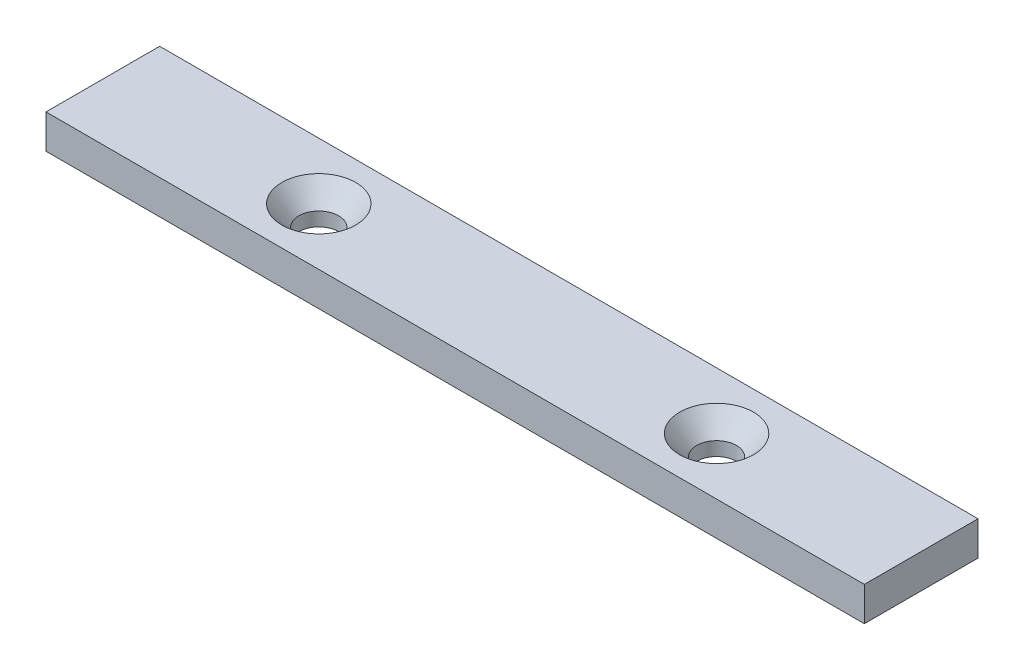
ISO-10303-21;
HEADER;
FILE_DESCRIPTION(('STEP AP214'),'2;1');
FILE_NAME('part.step','',(''),(''),'','','');
FILE_SCHEMA(('AUTOMOTIVE_DESIGN { 1 0 10303 214 1 1 1 1 }'));
ENDSEC;
DATA;
#1=APPLICATION_CONTEXT('core data for automotive mechanical design processes');
#2=APPLICATION_PROTOCOL_DEFINITION('international standard','automotive_design',2000,#1);
#3=PRODUCT_CONTEXT('',#1,'mechanical');
#4=PRODUCT('Part','Part','',(#3));
#5=PRODUCT_RELATED_PRODUCT_CATEGORY('part','',(#4));
#6=PRODUCT_DEFINITION_FORMATION('','',#4);
#7=PRODUCT_DEFINITION_CONTEXT('part definition',#1,'design');
#8=PRODUCT_DEFINITION('design','',#6,#7);
#9=PRODUCT_DEFINITION_SHAPE('','',#8);
#10=(LENGTH_UNIT() NAMED_UNIT(*) SI_UNIT(.MILLI.,.METRE.));
#11=(NAMED_UNIT(*) PLANE_ANGLE_UNIT() SI_UNIT($,.RADIAN.));
#12=(NAMED_UNIT(*) SI_UNIT($,.STERADIAN.) SOLID_ANGLE_UNIT());
#13=UNCERTAINTY_MEASURE_WITH_UNIT(LENGTH_MEASURE(1.E-05),#10,'distance_accuracy_value','');
#14=(GEOMETRIC_REPRESENTATION_CONTEXT(3) GLOBAL_UNCERTAINTY_ASSIGNED_CONTEXT((#13)) GLOBAL_UNIT_ASSIGNED_CONTEXT((#10,
#11,#12)) REPRESENTATION_CONTEXT('',''));
#15=CARTESIAN_POINT('',(0.,0.,0.));
#16=DIRECTION('',(0.,0.,1.));
#17=DIRECTION('',(1.,0.,0.));
#18=AXIS2_PLACEMENT_3D('',#15,#16,#17);
#19=CARTESIAN_POINT('',(0.,6.,0.));
#20=DIRECTION('',(1.,0.,0.));
#21=DIRECTION('',(0.,0.,-1.));
#22=AXIS2_PLACEMENT_3D('',#19,#20,#21);
#23=PLANE('',#22);
#24=DIRECTION('',(0.,0.,1.));
#25=VECTOR('',#24,1.);
#26=CARTESIAN_POINT('',(0.,0.,0.));
#27=LINE('',#26,#25);
#28=CARTESIAN_POINT('',(0.,0.,-20.));
#29=VERTEX_POINT('',#28);
#30=CARTESIAN_POINT('',(0.,0.,0.));
#31=VERTEX_POINT('',#30);
#32=EDGE_CURVE('E99',#29,#31,#27,.T.);
#33=ORIENTED_EDGE('',*,*,#32,.T.);
#34=DIRECTION('',(0.,-1.,0.));
#35=VECTOR('',#34,1.);
#36=CARTESIAN_POINT('',(0.,6.,0.));
#37=LINE('',#36,#35);
#38=CARTESIAN_POINT('',(0.,6.,0.));
#39=VERTEX_POINT('',#38);
#40=EDGE_CURVE('E11',#39,#31,#37,.T.);
#41=ORIENTED_EDGE('',*,*,#40,.F.);
#42=DIRECTION('',(0.,0.,1.));
#43=VECTOR('',#42,1.);
#44=CARTESIAN_POINT('',(0.,6.,0.));
#45=LINE('',#44,#43);
#46=CARTESIAN_POINT('',(0.,6.,-20.));
#47=VERTEX_POINT('',#46);
#48=EDGE_CURVE('E87',#47,#39,#45,.T.);
#49=ORIENTED_EDGE('',*,*,#48,.F.);
#50=DIRECTION('',(0.,-1.,0.));
#51=VECTOR('',#50,1.);
#52=CARTESIAN_POINT('',(0.,6.,-20.));
#53=LINE('',#52,#51);
#54=EDGE_CURVE('E95',#47,#29,#53,.T.);
#55=ORIENTED_EDGE('',*,*,#54,.T.);
#56=EDGE_LOOP('',(#33,#41,#49,#55));
#57=FACE_BOUND('',#56,.T.);
#58=ADVANCED_FACE('F36',(#57),#23,.F.);
#59=CARTESIAN_POINT('',(0.,6.,0.));
#60=DIRECTION('',(0.,0.,-1.));
#61=DIRECTION('',(-1.,0.,0.));
#62=AXIS2_PLACEMENT_3D('',#59,#60,#61);
#63=PLANE('',#62);
#64=DIRECTION('',(1.,0.,0.));
#65=VECTOR('',#64,1.);
#66=CARTESIAN_POINT('',(0.,0.,0.));
#67=LINE('',#66,#65);
#68=CARTESIAN_POINT('',(144.,0.,0.));
#69=VERTEX_POINT('',#68);
#70=EDGE_CURVE('E91',#31,#69,#67,.T.);
#71=ORIENTED_EDGE('',*,*,#70,.T.);
#72=DIRECTION('',(0.,-1.,0.));
#73=VECTOR('',#72,1.);
#74=CARTESIAN_POINT('',(144.,6.,0.));
#75=LINE('',#74,#73);
#76=CARTESIAN_POINT('',(144.,6.,0.));
#77=VERTEX_POINT('',#76);
#78=EDGE_CURVE('E44',#77,#69,#75,.T.);
#79=ORIENTED_EDGE('',*,*,#78,.F.);
#80=DIRECTION('',(1.,0.,0.));
#81=VECTOR('',#80,1.);
#82=CARTESIAN_POINT('',(0.,6.,0.));
#83=LINE('',#82,#81);
#84=EDGE_CURVE('E82',#39,#77,#83,.T.);
#85=ORIENTED_EDGE('',*,*,#84,.F.);
#86=ORIENTED_EDGE('',*,*,#40,.T.);
#87=EDGE_LOOP('',(#71,#79,#85,#86));
#88=FACE_BOUND('',#87,.T.);
#89=ADVANCED_FACE('F90',(#88),#63,.F.);
#90=CARTESIAN_POINT('',(144.,6.,0.));
#91=DIRECTION('',(-1.,0.,0.));
#92=DIRECTION('',(0.,0.,1.));
#93=AXIS2_PLACEMENT_3D('',#90,#91,#92);
#94=PLANE('',#93);
#95=DIRECTION('',(0.,0.,-1.));
#96=VECTOR('',#95,1.);
#97=CARTESIAN_POINT('',(144.,0.,0.));
#98=LINE('',#97,#96);
#99=CARTESIAN_POINT('',(144.,0.,-20.));
#100=VERTEX_POINT('',#99);
#101=EDGE_CURVE('E69',#69,#100,#98,.T.);
#102=ORIENTED_EDGE('',*,*,#101,.T.);
#103=DIRECTION('',(0.,-1.,0.));
#104=VECTOR('',#103,1.);
#105=CARTESIAN_POINT('',(144.,6.,-20.));
#106=LINE('',#105,#104);
#107=CARTESIAN_POINT('',(144.,6.,-20.));
#108=VERTEX_POINT('',#107);
#109=EDGE_CURVE('E92',#108,#100,#106,.T.);
#110=ORIENTED_EDGE('',*,*,#109,.F.);
#111=DIRECTION('',(0.,0.,-1.));
#112=VECTOR('',#111,1.);
#113=CARTESIAN_POINT('',(144.,6.,0.));
#114=LINE('',#113,#112);
#115=EDGE_CURVE('E85',#77,#108,#114,.T.);
#116=ORIENTED_EDGE('',*,*,#115,.F.);
#117=ORIENTED_EDGE('',*,*,#78,.T.);
#118=EDGE_LOOP('',(#102,#110,#116,#117));
#119=FACE_BOUND('',#118,.T.);
#120=ADVANCED_FACE('F93',(#119),#94,.F.);
#121=CARTESIAN_POINT('',(0.,6.,-20.));
#122=DIRECTION('',(0.,0.,1.));
#123=DIRECTION('',(1.,0.,0.));
#124=AXIS2_PLACEMENT_3D('',#121,#122,#123);
#125=PLANE('',#124);
#126=DIRECTION('',(-1.,0.,0.));
#127=VECTOR('',#126,1.);
#128=CARTESIAN_POINT('',(0.,0.,-20.));
#129=LINE('',#128,#127);
#130=EDGE_CURVE('E75',#100,#29,#129,.T.);
#131=ORIENTED_EDGE('',*,*,#130,.T.);
#132=ORIENTED_EDGE('',*,*,#54,.F.);
#133=DIRECTION('',(-1.,0.,0.));
#134=VECTOR('',#133,1.);
#135=CARTESIAN_POINT('',(0.,6.,-20.));
#136=LINE('',#135,#134);
#137=EDGE_CURVE('E52',#108,#47,#136,.T.);
#138=ORIENTED_EDGE('',*,*,#137,.F.);
#139=ORIENTED_EDGE('',*,*,#109,.T.);
#140=EDGE_LOOP('',(#131,#132,#138,#139));
#141=FACE_BOUND('',#140,.T.);
#142=ADVANCED_FACE('F107',(#141),#125,.F.);
#143=CARTESIAN_POINT('',(0.,6.,0.));
#144=DIRECTION('',(0.,-1.,0.));
#145=DIRECTION('',(0.,0.,-1.));
#146=AXIS2_PLACEMENT_3D('',#143,#144,#145);
#147=PLANE('',#146);
#148=CARTESIAN_POINT('',(38.,6.,-10.));
#149=DIRECTION('',(0.,1.,0.));
#150=DIRECTION('',(0.,0.,1.));
#151=AXIS2_PLACEMENT_3D('',#148,#149,#150);
#152=CIRCLE('',#151,6.5);
#153=CARTESIAN_POINT('',(38.,6.,-3.5));
#154=VERTEX_POINT('',#153);
#155=EDGE_CURVE('E127',#154,#154,#152,.T.);
#156=ORIENTED_EDGE('',*,*,#155,.F.);
#157=EDGE_LOOP('',(#156));
#158=FACE_BOUND('',#157,.T.);
#159=CARTESIAN_POINT('',(108.,6.,-10.));
#160=DIRECTION('',(0.,1.,0.));
#161=DIRECTION('',(0.,0.,1.));
#162=AXIS2_PLACEMENT_3D('',#159,#160,#161);
#163=CIRCLE('',#162,6.50000000000001);
#164=CARTESIAN_POINT('',(108.,6.,-3.49999999999999));
#165=VERTEX_POINT('',#164);
#166=EDGE_CURVE('E118',#165,#165,#163,.T.);
#167=ORIENTED_EDGE('',*,*,#166,.F.);
#168=EDGE_LOOP('',(#167));
#169=FACE_BOUND('',#168,.T.);
#170=ORIENTED_EDGE('',*,*,#48,.T.);
#171=ORIENTED_EDGE('',*,*,#84,.T.);
#172=ORIENTED_EDGE('',*,*,#115,.T.);
#173=ORIENTED_EDGE('',*,*,#137,.T.);
#174=EDGE_LOOP('',(#170,#171,#172,#173));
#175=FACE_BOUND('',#174,.T.);
#176=ADVANCED_FACE('F83',(#158,#169,#175),#147,.F.);
#177=CARTESIAN_POINT('',(0.,0.,0.));
#178=DIRECTION('',(0.,-1.,0.));
#179=DIRECTION('',(0.,0.,-1.));
#180=AXIS2_PLACEMENT_3D('',#177,#178,#179);
#181=PLANE('',#180);
#182=CARTESIAN_POINT('',(38.,0.,-10.));
#183=DIRECTION('',(0.,1.,0.));
#184=DIRECTION('',(0.,0.,1.));
#185=AXIS2_PLACEMENT_3D('',#182,#183,#184);
#186=CIRCLE('',#185,3.5);
#187=CARTESIAN_POINT('',(38.,0.,-6.5));
#188=VERTEX_POINT('',#187);
#189=EDGE_CURVE('E121',#188,#188,#186,.T.);
#190=ORIENTED_EDGE('',*,*,#189,.T.);
#191=EDGE_LOOP('',(#190));
#192=FACE_BOUND('',#191,.T.);
#193=CARTESIAN_POINT('',(108.,0.,-10.));
#194=DIRECTION('',(0.,1.,0.));
#195=DIRECTION('',(0.,0.,1.));
#196=AXIS2_PLACEMENT_3D('',#193,#194,#195);
#197=CIRCLE('',#196,3.5);
#198=CARTESIAN_POINT('',(108.,0.,-6.5));
#199=VERTEX_POINT('',#198);
#200=EDGE_CURVE('E102',#199,#199,#197,.T.);
#201=ORIENTED_EDGE('',*,*,#200,.T.);
#202=EDGE_LOOP('',(#201));
#203=FACE_BOUND('',#202,.T.);
#204=ORIENTED_EDGE('',*,*,#32,.F.);
#205=ORIENTED_EDGE('',*,*,#130,.F.);
#206=ORIENTED_EDGE('',*,*,#101,.F.);
#207=ORIENTED_EDGE('',*,*,#70,.F.);
#208=EDGE_LOOP('',(#204,#205,#206,#207));
#209=FACE_BOUND('',#208,.T.);
#210=ADVANCED_FACE('F110',(#192,#203,#209),#181,.T.);
#211=CARTESIAN_POINT('',(108.,6.,-10.));
#212=DIRECTION('',(0.,1.,0.));
#213=DIRECTION('',(0.,0.,1.));
#214=AXIS2_PLACEMENT_3D('',#211,#212,#213);
#215=CYLINDRICAL_SURFACE('',#214,3.5);
#216=ORIENTED_EDGE('',*,*,#200,.F.);
#217=EDGE_LOOP('',(#216));
#218=FACE_BOUND('',#217,.T.);
#219=CARTESIAN_POINT('',(108.,2.42473922221737,-10.));
#220=DIRECTION('',(0.,1.,0.));
#221=DIRECTION('',(0.,0.,1.));
#222=AXIS2_PLACEMENT_3D('',#219,#220,#221);
#223=CIRCLE('',#222,3.5);
#224=CARTESIAN_POINT('',(108.,2.42473922221737,-6.5));
#225=VERTEX_POINT('',#224);
#226=EDGE_CURVE('E115',#225,#225,#223,.T.);
#227=ORIENTED_EDGE('',*,*,#226,.T.);
#228=EDGE_LOOP('',(#227));
#229=FACE_BOUND('',#228,.T.);
#230=ADVANCED_FACE('F141',(#218,#229),#215,.F.);
#231=CARTESIAN_POINT('',(108.,6.,-10.));
#232=DIRECTION('',(0.,1.,0.));
#233=DIRECTION('',(0.,0.,1.));
#234=AXIS2_PLACEMENT_3D('',#231,#232,#233);
#235=CONICAL_SURFACE('',#234,6.50000000000001,0.698131700797732);
#236=ORIENTED_EDGE('',*,*,#226,.F.);
#237=EDGE_LOOP('',(#236));
#238=FACE_BOUND('',#237,.T.);
#239=ORIENTED_EDGE('',*,*,#166,.T.);
#240=EDGE_LOOP('',(#239));
#241=FACE_BOUND('',#240,.T.);
#242=ADVANCED_FACE('F138',(#238,#241),#235,.F.);
#243=CARTESIAN_POINT('',(38.,6.,-10.));
#244=DIRECTION('',(0.,1.,0.));
#245=DIRECTION('',(0.,0.,1.));
#246=AXIS2_PLACEMENT_3D('',#243,#244,#245);
#247=CYLINDRICAL_SURFACE('',#246,3.5);
#248=ORIENTED_EDGE('',*,*,#189,.F.);
#249=EDGE_LOOP('',(#248));
#250=FACE_BOUND('',#249,.T.);
#251=CARTESIAN_POINT('',(38.,2.42473922221737,-10.));
#252=DIRECTION('',(0.,1.,0.));
#253=DIRECTION('',(0.,0.,1.));
#254=AXIS2_PLACEMENT_3D('',#251,#252,#253);
#255=CIRCLE('',#254,3.5);
#256=CARTESIAN_POINT('',(38.,2.42473922221737,-6.5));
#257=VERTEX_POINT('',#256);
#258=EDGE_CURVE('E124',#257,#257,#255,.T.);
#259=ORIENTED_EDGE('',*,*,#258,.T.);
#260=EDGE_LOOP('',(#259));
#261=FACE_BOUND('',#260,.T.);
#262=ADVANCED_FACE('F140',(#250,#261),#247,.F.);
#263=CARTESIAN_POINT('',(38.,6.,-10.));
#264=DIRECTION('',(0.,1.,0.));
#265=DIRECTION('',(0.,0.,1.));
#266=AXIS2_PLACEMENT_3D('',#263,#264,#265);
#267=CONICAL_SURFACE('',#266,6.5,0.698131700797731);
#268=ORIENTED_EDGE('',*,*,#258,.F.);
#269=EDGE_LOOP('',(#268));
#270=FACE_BOUND('',#269,.T.);
#271=ORIENTED_EDGE('',*,*,#155,.T.);
#272=EDGE_LOOP('',(#271));
#273=FACE_BOUND('',#272,.T.);
#274=ADVANCED_FACE('F131',(#270,#273),#267,.F.);
#275=CLOSED_SHELL('',(#58,#89,#120,#142,#176,#210,#230,#242,#262,#274));
#276=MANIFOLD_SOLID_BREP('B2',#275);
#277=ADVANCED_BREP_SHAPE_REPRESENTATION('',(#18,#276),#14);
#278=SHAPE_DEFINITION_REPRESENTATION(#9,#277);
ENDSEC;
END-ISO-10303-21;
